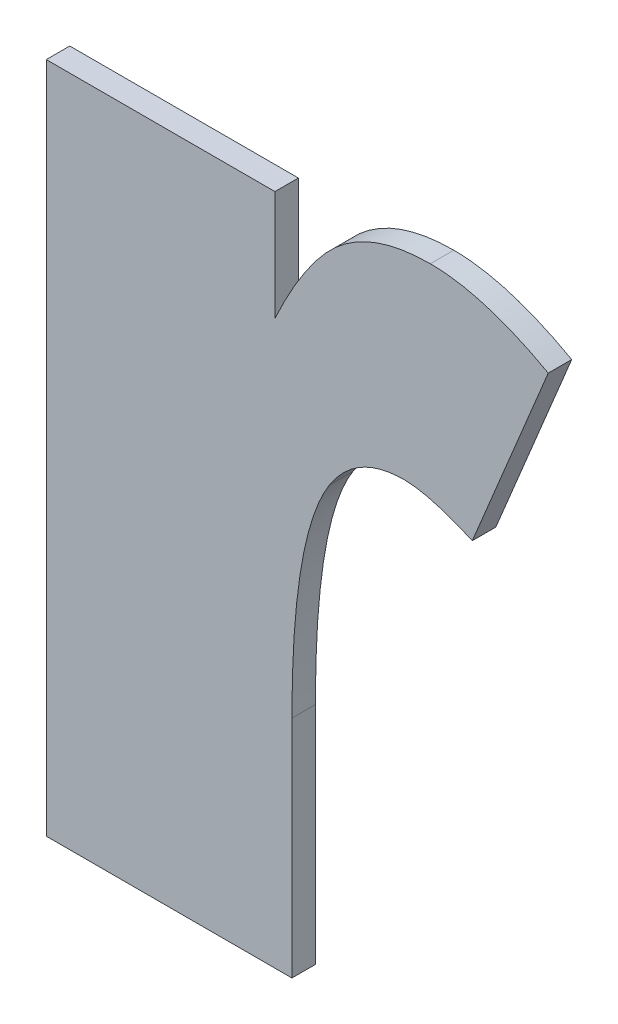
ISO-10303-21;
HEADER;
FILE_DESCRIPTION(('STEP AP214'),'2;1');
FILE_NAME('part.step','',(''),(''),'','','');
FILE_SCHEMA(('AUTOMOTIVE_DESIGN { 1 0 10303 214 1 1 1 1 }'));
ENDSEC;
DATA;
#1=APPLICATION_CONTEXT('core data for automotive mechanical design processes');
#2=APPLICATION_PROTOCOL_DEFINITION('international standard','automotive_design',2000,#1);
#3=PRODUCT_CONTEXT('',#1,'mechanical');
#4=PRODUCT('Part','Part','',(#3));
#5=PRODUCT_RELATED_PRODUCT_CATEGORY('part','',(#4));
#6=PRODUCT_DEFINITION_FORMATION('','',#4);
#7=PRODUCT_DEFINITION_CONTEXT('part definition',#1,'design');
#8=PRODUCT_DEFINITION('design','',#6,#7);
#9=PRODUCT_DEFINITION_SHAPE('','',#8);
#10=(LENGTH_UNIT() NAMED_UNIT(*) SI_UNIT(.MILLI.,.METRE.));
#11=(NAMED_UNIT(*) PLANE_ANGLE_UNIT() SI_UNIT($,.RADIAN.));
#12=(NAMED_UNIT(*) SI_UNIT($,.STERADIAN.) SOLID_ANGLE_UNIT());
#13=UNCERTAINTY_MEASURE_WITH_UNIT(LENGTH_MEASURE(1.E-05),#10,'distance_accuracy_value','');
#14=(GEOMETRIC_REPRESENTATION_CONTEXT(3) GLOBAL_UNCERTAINTY_ASSIGNED_CONTEXT((#13)) GLOBAL_UNIT_ASSIGNED_CONTEXT((#10,
#11,#12)) REPRESENTATION_CONTEXT('',''));
#15=CARTESIAN_POINT('',(0.,0.,0.));
#16=DIRECTION('',(0.,0.,1.));
#17=DIRECTION('',(1.,0.,0.));
#18=AXIS2_PLACEMENT_3D('',#15,#16,#17);
#19=CARTESIAN_POINT('',(0.959673311300421,-0.722568280483534,0.));
#20=DIRECTION('',(1.,0.,0.));
#21=DIRECTION('',(0.,1.,0.));
#22=AXIS2_PLACEMENT_3D('',#19,#20,#21);
#23=PLANE('',#22);
#24=DIRECTION('',(0.,1.,0.));
#25=VECTOR('',#24,1.);
#26=CARTESIAN_POINT('',(0.959673311300421,-0.722568280483534,0.));
#27=LINE('',#26,#25);
#28=CARTESIAN_POINT('',(0.959673311300421,-0.722568280483534,0.));
#29=VERTEX_POINT('',#28);
#30=CARTESIAN_POINT('',(0.959673311300421,-0.693812631181233,0.));
#31=VERTEX_POINT('',#30);
#32=EDGE_CURVE('E11',#29,#31,#27,.T.);
#33=ORIENTED_EDGE('',*,*,#32,.T.);
#34=DIRECTION('',(0.,0.,1.));
#35=VECTOR('',#34,1.);
#36=CARTESIAN_POINT('',(0.959673311300421,-0.693812631181233,0.));
#37=LINE('',#36,#35);
#38=CARTESIAN_POINT('',(0.959673311300421,-0.693812631181233,0.003));
#39=VERTEX_POINT('',#38);
#40=EDGE_CURVE('E24',#31,#39,#37,.T.);
#41=ORIENTED_EDGE('',*,*,#40,.T.);
#42=DIRECTION('',(0.,1.,0.));
#43=VECTOR('',#42,1.);
#44=CARTESIAN_POINT('',(0.959673311300421,-0.722568280483534,0.003));
#45=LINE('',#44,#43);
#46=CARTESIAN_POINT('',(0.959673311300421,-0.722568280483534,0.003));
#47=VERTEX_POINT('',#46);
#48=EDGE_CURVE('E118',#47,#39,#45,.T.);
#49=ORIENTED_EDGE('',*,*,#48,.F.);
#50=DIRECTION('',(0.,0.,1.));
#51=VECTOR('',#50,1.);
#52=CARTESIAN_POINT('',(0.959673311300421,-0.722568280483534,0.));
#53=LINE('',#52,#51);
#54=EDGE_CURVE('E241',#29,#47,#53,.T.);
#55=ORIENTED_EDGE('',*,*,#54,.F.);
#56=EDGE_LOOP('',(#33,#41,#49,#55));
#57=FACE_BOUND('',#56,.T.);
#58=ADVANCED_FACE('F17',(#57),#23,.T.);
#59=CARTESIAN_POINT('',(0.928293138450689,-0.722568280483534,0.));
#60=DIRECTION('',(0.,-1.,0.));
#61=DIRECTION('',(1.,0.,0.));
#62=AXIS2_PLACEMENT_3D('',#59,#60,#61);
#63=PLANE('',#62);
#64=DIRECTION('',(1.,0.,0.));
#65=VECTOR('',#64,1.);
#66=CARTESIAN_POINT('',(0.928293138450689,-0.722568280483534,0.));
#67=LINE('',#66,#65);
#68=CARTESIAN_POINT('',(0.928293138450689,-0.722568280483534,0.));
#69=VERTEX_POINT('',#68);
#70=EDGE_CURVE('E238',#69,#29,#67,.T.);
#71=ORIENTED_EDGE('',*,*,#70,.T.);
#72=ORIENTED_EDGE('',*,*,#54,.T.);
#73=DIRECTION('',(1.,0.,0.));
#74=VECTOR('',#73,1.);
#75=CARTESIAN_POINT('',(0.928293138450689,-0.722568280483534,0.003));
#76=LINE('',#75,#74);
#77=CARTESIAN_POINT('',(0.928293138450689,-0.722568280483534,0.003));
#78=VERTEX_POINT('',#77);
#79=EDGE_CURVE('E236',#78,#47,#76,.T.);
#80=ORIENTED_EDGE('',*,*,#79,.F.);
#81=DIRECTION('',(0.,0.,1.));
#82=VECTOR('',#81,1.);
#83=CARTESIAN_POINT('',(0.928293138450689,-0.722568280483534,0.));
#84=LINE('',#83,#82);
#85=EDGE_CURVE('E233',#69,#78,#84,.T.);
#86=ORIENTED_EDGE('',*,*,#85,.F.);
#87=EDGE_LOOP('',(#71,#72,#80,#86));
#88=FACE_BOUND('',#87,.T.);
#89=ADVANCED_FACE('F267',(#88),#63,.T.);
#90=CARTESIAN_POINT('',(0.928293138450689,-0.636643661734989,0.));
#91=DIRECTION('',(-1.,0.,0.));
#92=DIRECTION('',(0.,-1.,0.));
#93=AXIS2_PLACEMENT_3D('',#90,#91,#92);
#94=PLANE('',#93);
#95=DIRECTION('',(0.,-1.,0.));
#96=VECTOR('',#95,1.);
#97=CARTESIAN_POINT('',(0.928293138450689,-0.636643661734989,0.));
#98=LINE('',#97,#96);
#99=CARTESIAN_POINT('',(0.928293138450689,-0.636643661734989,0.));
#100=VERTEX_POINT('',#99);
#101=EDGE_CURVE('E230',#100,#69,#98,.T.);
#102=ORIENTED_EDGE('',*,*,#101,.T.);
#103=ORIENTED_EDGE('',*,*,#85,.T.);
#104=DIRECTION('',(0.,-1.,0.));
#105=VECTOR('',#104,1.);
#106=CARTESIAN_POINT('',(0.928293138450689,-0.636643661734989,0.003));
#107=LINE('',#106,#105);
#108=CARTESIAN_POINT('',(0.928293138450689,-0.636643661734989,0.003));
#109=VERTEX_POINT('',#108);
#110=EDGE_CURVE('E227',#109,#78,#107,.T.);
#111=ORIENTED_EDGE('',*,*,#110,.F.);
#112=DIRECTION('',(0.,0.,1.));
#113=VECTOR('',#112,1.);
#114=CARTESIAN_POINT('',(0.928293138450689,-0.636643661734989,0.));
#115=LINE('',#114,#113);
#116=EDGE_CURVE('E224',#100,#109,#115,.T.);
#117=ORIENTED_EDGE('',*,*,#116,.F.);
#118=EDGE_LOOP('',(#102,#103,#111,#117));
#119=FACE_BOUND('',#118,.T.);
#120=ADVANCED_FACE('F264',(#119),#94,.T.);
#121=CARTESIAN_POINT('',(0.957505226630804,-0.636643661734989,0.));
#122=DIRECTION('',(0.,1.,0.));
#123=DIRECTION('',(-1.,0.,0.));
#124=AXIS2_PLACEMENT_3D('',#121,#122,#123);
#125=PLANE('',#124);
#126=DIRECTION('',(-1.,0.,0.));
#127=VECTOR('',#126,1.);
#128=CARTESIAN_POINT('',(0.957505226630804,-0.636643661734989,0.));
#129=LINE('',#128,#127);
#130=CARTESIAN_POINT('',(0.957505226630804,-0.636643661734989,0.));
#131=VERTEX_POINT('',#130);
#132=EDGE_CURVE('E221',#131,#100,#129,.T.);
#133=ORIENTED_EDGE('',*,*,#132,.T.);
#134=ORIENTED_EDGE('',*,*,#116,.T.);
#135=DIRECTION('',(-1.,0.,0.));
#136=VECTOR('',#135,1.);
#137=CARTESIAN_POINT('',(0.957505226630804,-0.636643661734989,0.003));
#138=LINE('',#137,#136);
#139=CARTESIAN_POINT('',(0.957505226630804,-0.636643661734989,0.003));
#140=VERTEX_POINT('',#139);
#141=EDGE_CURVE('E218',#140,#109,#138,.T.);
#142=ORIENTED_EDGE('',*,*,#141,.F.);
#143=DIRECTION('',(0.,0.,1.));
#144=VECTOR('',#143,1.);
#145=CARTESIAN_POINT('',(0.957505226630804,-0.636643661734989,0.));
#146=LINE('',#145,#144);
#147=EDGE_CURVE('E215',#131,#140,#146,.T.);
#148=ORIENTED_EDGE('',*,*,#147,.F.);
#149=EDGE_LOOP('',(#133,#134,#142,#148));
#150=FACE_BOUND('',#149,.T.);
#151=ADVANCED_FACE('F261',(#150),#125,.T.);
#152=CARTESIAN_POINT('',(0.957505226630804,-0.650679157227781,0.));
#153=DIRECTION('',(1.,0.,0.));
#154=DIRECTION('',(0.,1.,0.));
#155=AXIS2_PLACEMENT_3D('',#152,#153,#154);
#156=PLANE('',#155);
#157=DIRECTION('',(0.,1.,0.));
#158=VECTOR('',#157,1.);
#159=CARTESIAN_POINT('',(0.957505226630804,-0.650679157227781,0.));
#160=LINE('',#159,#158);
#161=CARTESIAN_POINT('',(0.957505226630804,-0.650679157227781,0.));
#162=VERTEX_POINT('',#161);
#163=EDGE_CURVE('E212',#162,#131,#160,.T.);
#164=ORIENTED_EDGE('',*,*,#163,.T.);
#165=ORIENTED_EDGE('',*,*,#147,.T.);
#166=DIRECTION('',(0.,1.,0.));
#167=VECTOR('',#166,1.);
#168=CARTESIAN_POINT('',(0.957505226630804,-0.650679157227781,0.003));
#169=LINE('',#168,#167);
#170=CARTESIAN_POINT('',(0.957505226630804,-0.650679157227781,0.003));
#171=VERTEX_POINT('',#170);
#172=EDGE_CURVE('E209',#171,#140,#169,.T.);
#173=ORIENTED_EDGE('',*,*,#172,.F.);
#174=DIRECTION('',(0.,0.,1.));
#175=VECTOR('',#174,1.);
#176=CARTESIAN_POINT('',(0.957505226630804,-0.650679157227781,0.));
#177=LINE('',#176,#175);
#178=EDGE_CURVE('E203',#162,#171,#177,.T.);
#179=ORIENTED_EDGE('',*,*,#178,.F.);
#180=EDGE_LOOP('',(#164,#165,#173,#179));
#181=FACE_BOUND('',#180,.T.);
#182=ADVANCED_FACE('F258',(#181),#156,.T.);
#183=CARTESIAN_POINT('',(0.977360317815728,-0.634703796504277,0.));
#184=CARTESIAN_POINT('',(0.977360317815728,-0.634703796504277,0.003));
#185=CARTESIAN_POINT('',(0.970741954087347,-0.634703796643713,0.));
#186=CARTESIAN_POINT('',(0.970741954087347,-0.634703796643713,0.003));
#187=CARTESIAN_POINT('',(0.961727286394888,-0.641550380000914,0.));
#188=CARTESIAN_POINT('',(0.961727286394888,-0.641550380000914,0.003));
#189=CARTESIAN_POINT('',(0.957505226630804,-0.650679157227781,0.));
#190=CARTESIAN_POINT('',(0.957505226630804,-0.650679157227781,0.003));
#191=B_SPLINE_SURFACE_WITH_KNOTS('',2,1,((#183,#184),(#185,#186),(#187,#188),(#189,#190)),
.UNSPECIFIED.,.F.,.F.,.F.,(3,1,3),(2,2),(-2.,-1.,0.),(0.,0.0003),.UNSPECIFIED.);
#192=CARTESIAN_POINT('',(0.977360317815728,-0.634703796504277,0.));
#193=CARTESIAN_POINT('',(0.970741954087347,-0.634703796643713,0.));
#194=CARTESIAN_POINT('',(0.961727286394888,-0.641550380000914,0.));
#195=CARTESIAN_POINT('',(0.957505226630804,-0.650679157227781,0.));
#196=B_SPLINE_CURVE_WITH_KNOTS('',2,(#192,#193,#194,#195),.UNSPECIFIED.,.F.,.F.,(3,1,3),(-2.,
-1.,0.),.UNSPECIFIED.);
#197=CARTESIAN_POINT('',(0.977360317815728,-0.634703796504277,0.));
#198=VERTEX_POINT('',#197);
#199=EDGE_CURVE('E195',#198,#162,#196,.T.);
#200=CARTESIAN_POINT('',(0.977360317815728,-0.634703796504277,0.003));
#201=CARTESIAN_POINT('',(0.970741954087347,-0.634703796643713,0.003));
#202=CARTESIAN_POINT('',(0.961727286394888,-0.641550380000914,0.003));
#203=CARTESIAN_POINT('',(0.957505226630804,-0.650679157227781,0.003));
#204=B_SPLINE_CURVE_WITH_KNOTS('',2,(#200,#201,#202,#203),.UNSPECIFIED.,.F.,.F.,(3,1,3),(-2.,
-1.,0.),.UNSPECIFIED.);
#205=CARTESIAN_POINT('',(0.977360317815728,-0.634703796504277,0.003));
#206=VERTEX_POINT('',#205);
#207=EDGE_CURVE('E190',#206,#171,#204,.T.);
#208=DIRECTION('',(0.,0.,1.));
#209=VECTOR('',#208,1.);
#210=CARTESIAN_POINT('',(0.977360317815728,-0.634703796504277,0.));
#211=LINE('',#210,#209);
#212=EDGE_CURVE('E184',#198,#206,#211,.T.);
#213=ORIENTED_EDGE('',*,*,#199,.T.);
#214=ORIENTED_EDGE('',*,*,#178,.T.);
#215=ORIENTED_EDGE('',*,*,#207,.F.);
#216=ORIENTED_EDGE('',*,*,#212,.F.);
#217=EDGE_LOOP('',(#213,#214,#215,#216));
#218=FACE_BOUND('',#217,.T.);
#219=ADVANCED_FACE('F255',(#218),#191,.T.);
#220=CARTESIAN_POINT('',(0.992422800783596,-0.639268185282421,0.));
#221=CARTESIAN_POINT('',(0.992422800783596,-0.639268185282421,0.003));
#222=CARTESIAN_POINT('',(0.984206893287916,-0.634703810355245,0.));
#223=CARTESIAN_POINT('',(0.984206893287916,-0.634703810355245,0.003));
#224=CARTESIAN_POINT('',(0.977360317815728,-0.634703796504277,0.));
#225=CARTESIAN_POINT('',(0.977360317815728,-0.634703796504277,0.003));
#226=B_SPLINE_SURFACE_WITH_KNOTS('',2,1,((#220,#221),(#222,#223),(#224,#225)),.UNSPECIFIED.,.F.,
.F.,.F.,(3,3),(2,2),(-1.,0.),(0.,0.0003),.UNSPECIFIED.);
#227=CARTESIAN_POINT('',(0.992422800783596,-0.639268185282421,0.));
#228=CARTESIAN_POINT('',(0.984206893287916,-0.634703810355245,0.));
#229=CARTESIAN_POINT('',(0.977360317815728,-0.634703796504277,0.));
#230=B_SPLINE_CURVE_WITH_KNOTS('',2,(#227,#228,#229),.UNSPECIFIED.,.F.,.F.,(3,3),(-1.,0.),.UNSPECIFIED.);
#231=CARTESIAN_POINT('',(0.992422800783596,-0.639268185282421,0.));
#232=VERTEX_POINT('',#231);
#233=EDGE_CURVE('E176',#232,#198,#230,.T.);
#234=CARTESIAN_POINT('',(0.992422800783596,-0.639268185282421,0.003));
#235=CARTESIAN_POINT('',(0.984206893287916,-0.634703810355245,0.003));
#236=CARTESIAN_POINT('',(0.977360317815728,-0.634703796504277,0.003));
#237=B_SPLINE_CURVE_WITH_KNOTS('',2,(#234,#235,#236),.UNSPECIFIED.,.F.,.F.,(3,3),(-1.,0.),.UNSPECIFIED.);
#238=CARTESIAN_POINT('',(0.992422800783596,-0.639268185282421,0.003));
#239=VERTEX_POINT('',#238);
#240=EDGE_CURVE('E171',#239,#206,#237,.T.);
#241=DIRECTION('',(0.,0.,1.));
#242=VECTOR('',#241,1.);
#243=CARTESIAN_POINT('',(0.992422800783596,-0.639268185282421,0.));
#244=LINE('',#243,#242);
#245=EDGE_CURVE('E168',#232,#239,#244,.T.);
#246=ORIENTED_EDGE('',*,*,#233,.T.);
#247=ORIENTED_EDGE('',*,*,#212,.T.);
#248=ORIENTED_EDGE('',*,*,#240,.F.);
#249=ORIENTED_EDGE('',*,*,#245,.F.);
#250=EDGE_LOOP('',(#246,#247,#248,#249));
#251=FACE_BOUND('',#250,.T.);
#252=ADVANCED_FACE('F252',(#251),#226,.T.);
#253=CARTESIAN_POINT('',(0.982723474630046,-0.662660677770404,0.));
#254=DIRECTION('',(0.923742113571684,-0.38301502270031,0.));
#255=DIRECTION('',(0.38301502270031,0.923742113571684,0.));
#256=AXIS2_PLACEMENT_3D('',#253,#254,#255);
#257=PLANE('',#256);
#258=DIRECTION('',(0.38301502270031,0.923742113571684,0.));
#259=VECTOR('',#258,1.);
#260=CARTESIAN_POINT('',(0.982723474630046,-0.662660677770404,0.));
#261=LINE('',#260,#259);
#262=CARTESIAN_POINT('',(0.982723474630046,-0.662660677770404,0.));
#263=VERTEX_POINT('',#262);
#264=EDGE_CURVE('E165',#263,#232,#261,.T.);
#265=ORIENTED_EDGE('',*,*,#264,.T.);
#266=ORIENTED_EDGE('',*,*,#245,.T.);
#267=DIRECTION('',(0.38301502270031,0.923742113571684,0.));
#268=VECTOR('',#267,1.);
#269=CARTESIAN_POINT('',(0.982723474630046,-0.662660677770404,0.003));
#270=LINE('',#269,#268);
#271=CARTESIAN_POINT('',(0.982723474630046,-0.662660677770404,0.003));
#272=VERTEX_POINT('',#271);
#273=EDGE_CURVE('E162',#272,#239,#270,.T.);
#274=ORIENTED_EDGE('',*,*,#273,.F.);
#275=DIRECTION('',(0.,0.,1.));
#276=VECTOR('',#275,1.);
#277=CARTESIAN_POINT('',(0.982723474630046,-0.662660677770404,0.));
#278=LINE('',#277,#276);
#279=EDGE_CURVE('E156',#263,#272,#278,.T.);
#280=ORIENTED_EDGE('',*,*,#279,.F.);
#281=EDGE_LOOP('',(#265,#266,#274,#280));
#282=FACE_BOUND('',#281,.T.);
#283=ADVANCED_FACE('F249',(#282),#257,.T.);
#284=CARTESIAN_POINT('',(0.974051135951572,-0.660264373661884,0.));
#285=CARTESIAN_POINT('',(0.974051135951572,-0.660264373661884,0.003));
#286=CARTESIAN_POINT('',(0.977246208096205,-0.660264371843956,0.));
#287=CARTESIAN_POINT('',(0.977246208096205,-0.660264371843956,0.003));
#288=CARTESIAN_POINT('',(0.982723474630046,-0.662660677770404,0.));
#289=CARTESIAN_POINT('',(0.982723474630046,-0.662660677770404,0.003));
#290=B_SPLINE_SURFACE_WITH_KNOTS('',2,1,((#284,#285),(#286,#287),(#288,#289)),.UNSPECIFIED.,.F.,
.F.,.F.,(3,3),(2,2),(-1.,0.),(0.,0.0003),.UNSPECIFIED.);
#291=CARTESIAN_POINT('',(0.974051135951572,-0.660264373661884,0.));
#292=CARTESIAN_POINT('',(0.977246208096205,-0.660264371843956,0.));
#293=CARTESIAN_POINT('',(0.982723474630046,-0.662660677770404,0.));
#294=B_SPLINE_CURVE_WITH_KNOTS('',2,(#291,#292,#293),.UNSPECIFIED.,.F.,.F.,(3,3),(-1.,0.),.UNSPECIFIED.);
#295=CARTESIAN_POINT('',(0.974051135951572,-0.660264373661884,0.));
#296=VERTEX_POINT('',#295);
#297=EDGE_CURVE('E148',#296,#263,#294,.T.);
#298=CARTESIAN_POINT('',(0.974051135951572,-0.660264373661884,0.003));
#299=CARTESIAN_POINT('',(0.977246208096205,-0.660264371843956,0.003));
#300=CARTESIAN_POINT('',(0.982723474630046,-0.662660677770404,0.003));
#301=B_SPLINE_CURVE_WITH_KNOTS('',2,(#298,#299,#300),.UNSPECIFIED.,.F.,.F.,(3,3),(-1.,0.),.UNSPECIFIED.);
#302=CARTESIAN_POINT('',(0.974051135951572,-0.660264373661884,0.003));
#303=VERTEX_POINT('',#302);
#304=EDGE_CURVE('E144',#303,#272,#301,.T.);
#305=DIRECTION('',(0.,0.,1.));
#306=VECTOR('',#305,1.);
#307=CARTESIAN_POINT('',(0.974051135951572,-0.660264373661884,0.));
#308=LINE('',#307,#306);
#309=EDGE_CURVE('E103',#296,#303,#308,.T.);
#310=ORIENTED_EDGE('',*,*,#297,.T.);
#311=ORIENTED_EDGE('',*,*,#279,.T.);
#312=ORIENTED_EDGE('',*,*,#304,.F.);
#313=ORIENTED_EDGE('',*,*,#309,.F.);
#314=EDGE_LOOP('',(#310,#311,#312,#313));
#315=FACE_BOUND('',#314,.T.);
#316=ADVANCED_FACE('F247',(#315),#290,.T.);
#317=CARTESIAN_POINT('',(0.964465919517469,-0.665627530476201,0.));
#318=CARTESIAN_POINT('',(0.964465919517469,-0.665627530476201,0.003));
#319=CARTESIAN_POINT('',(0.96788921102113,-0.660264373610875,0.));
#320=CARTESIAN_POINT('',(0.96788921102113,-0.660264373610875,0.003));
#321=CARTESIAN_POINT('',(0.974051135951572,-0.660264373661884,0.));
#322=CARTESIAN_POINT('',(0.974051135951572,-0.660264373661884,0.003));
#323=B_SPLINE_SURFACE_WITH_KNOTS('',2,1,((#317,#318),(#319,#320),(#321,#322)),.UNSPECIFIED.,.F.,
.F.,.F.,(3,3),(2,2),(-1.,0.),(0.,0.0003),.UNSPECIFIED.);
#324=CARTESIAN_POINT('',(0.964465919517469,-0.665627530476201,0.));
#325=CARTESIAN_POINT('',(0.96788921102113,-0.660264373610875,0.));
#326=CARTESIAN_POINT('',(0.974051135951572,-0.660264373661884,0.));
#327=B_SPLINE_CURVE_WITH_KNOTS('',2,(#324,#325,#326),.UNSPECIFIED.,.F.,.F.,(3,3),(-1.,0.),.UNSPECIFIED.);
#328=CARTESIAN_POINT('',(0.964465919517469,-0.665627530476201,0.));
#329=VERTEX_POINT('',#328);
#330=EDGE_CURVE('E107',#329,#296,#327,.T.);
#331=CARTESIAN_POINT('',(0.964465919517469,-0.665627530476201,0.003));
#332=CARTESIAN_POINT('',(0.96788921102113,-0.660264373610875,0.003));
#333=CARTESIAN_POINT('',(0.974051135951572,-0.660264373661884,0.003));
#334=B_SPLINE_CURVE_WITH_KNOTS('',2,(#331,#332,#333),.UNSPECIFIED.,.F.,.F.,(3,3),(-1.,0.),.UNSPECIFIED.);
#335=CARTESIAN_POINT('',(0.964465919517469,-0.665627530476201,0.003));
#336=VERTEX_POINT('',#335);
#337=EDGE_CURVE('E96',#336,#303,#334,.T.);
#338=DIRECTION('',(0.,0.,1.));
#339=VECTOR('',#338,1.);
#340=CARTESIAN_POINT('',(0.964465919517469,-0.665627530476201,0.));
#341=LINE('',#340,#339);
#342=EDGE_CURVE('E100',#329,#336,#341,.T.);
#343=ORIENTED_EDGE('',*,*,#330,.T.);
#344=ORIENTED_EDGE('',*,*,#309,.T.);
#345=ORIENTED_EDGE('',*,*,#337,.F.);
#346=ORIENTED_EDGE('',*,*,#342,.F.);
#347=EDGE_LOOP('',(#343,#344,#345,#346));
#348=FACE_BOUND('',#347,.T.);
#349=ADVANCED_FACE('F99',(#348),#323,.T.);
#350=CARTESIAN_POINT('',(0.959673311300421,-0.693812631181233,0.));
#351=CARTESIAN_POINT('',(0.959673311300421,-0.693812631181233,0.003));
#352=CARTESIAN_POINT('',(0.95967330729947,-0.673158771960145,0.));
#353=CARTESIAN_POINT('',(0.95967330729947,-0.673158771960145,0.003));
#354=CARTESIAN_POINT('',(0.964465919517469,-0.665627530476201,0.));
#355=CARTESIAN_POINT('',(0.964465919517469,-0.665627530476201,0.003));
#356=B_SPLINE_SURFACE_WITH_KNOTS('',2,1,((#350,#351),(#352,#353),(#354,#355)),.UNSPECIFIED.,.F.,
.F.,.F.,(3,3),(2,2),(-1.,0.),(0.,0.0003),.UNSPECIFIED.);
#357=CARTESIAN_POINT('',(0.959673311300421,-0.693812631181233,0.));
#358=CARTESIAN_POINT('',(0.95967330729947,-0.673158771960145,0.));
#359=CARTESIAN_POINT('',(0.964465919517469,-0.665627530476201,0.));
#360=B_SPLINE_CURVE_WITH_KNOTS('',2,(#357,#358,#359),.UNSPECIFIED.,.F.,.F.,(3,3),(-1.,0.),.UNSPECIFIED.);
#361=EDGE_CURVE('E113',#31,#329,#360,.T.);
#362=CARTESIAN_POINT('',(0.959673311300421,-0.693812631181233,0.003));
#363=CARTESIAN_POINT('',(0.95967330729947,-0.673158771960145,0.003));
#364=CARTESIAN_POINT('',(0.964465919517469,-0.665627530476201,0.003));
#365=B_SPLINE_CURVE_WITH_KNOTS('',2,(#362,#363,#364),.UNSPECIFIED.,.F.,.F.,(3,3),(-1.,0.),.UNSPECIFIED.);
#366=EDGE_CURVE('E112',#39,#336,#365,.T.);
#367=ORIENTED_EDGE('',*,*,#361,.T.);
#368=ORIENTED_EDGE('',*,*,#342,.T.);
#369=ORIENTED_EDGE('',*,*,#366,.F.);
#370=ORIENTED_EDGE('',*,*,#40,.F.);
#371=EDGE_LOOP('',(#367,#368,#369,#370));
#372=FACE_BOUND('',#371,.T.);
#373=ADVANCED_FACE('F111',(#372),#356,.T.);
#374=CARTESIAN_POINT('',(0.960357969617142,-0.678636038493905,0.003));
#375=DIRECTION('',(0.,0.,1.));
#376=DIRECTION('',(1.,0.,0.));
#377=AXIS2_PLACEMENT_3D('',#374,#375,#376);
#378=PLANE('',#377);
#379=ORIENTED_EDGE('',*,*,#366,.T.);
#380=ORIENTED_EDGE('',*,*,#337,.T.);
#381=ORIENTED_EDGE('',*,*,#304,.T.);
#382=ORIENTED_EDGE('',*,*,#273,.T.);
#383=ORIENTED_EDGE('',*,*,#240,.T.);
#384=ORIENTED_EDGE('',*,*,#207,.T.);
#385=ORIENTED_EDGE('',*,*,#172,.T.);
#386=ORIENTED_EDGE('',*,*,#141,.T.);
#387=ORIENTED_EDGE('',*,*,#110,.T.);
#388=ORIENTED_EDGE('',*,*,#79,.T.);
#389=ORIENTED_EDGE('',*,*,#48,.T.);
#390=EDGE_LOOP('',(#379,#380,#381,#382,#383,#384,#385,#386,#387,#388,#389));
#391=FACE_BOUND('',#390,.T.);
#392=ADVANCED_FACE('F116',(#391),#378,.T.);
#393=CARTESIAN_POINT('',(0.960357969617142,-0.678636038493905,0.));
#394=DIRECTION('',(0.,0.,1.));
#395=DIRECTION('',(1.,0.,0.));
#396=AXIS2_PLACEMENT_3D('',#393,#394,#395);
#397=PLANE('',#396);
#398=ORIENTED_EDGE('',*,*,#361,.F.);
#399=ORIENTED_EDGE('',*,*,#32,.F.);
#400=ORIENTED_EDGE('',*,*,#70,.F.);
#401=ORIENTED_EDGE('',*,*,#101,.F.);
#402=ORIENTED_EDGE('',*,*,#132,.F.);
#403=ORIENTED_EDGE('',*,*,#163,.F.);
#404=ORIENTED_EDGE('',*,*,#199,.F.);
#405=ORIENTED_EDGE('',*,*,#233,.F.);
#406=ORIENTED_EDGE('',*,*,#264,.F.);
#407=ORIENTED_EDGE('',*,*,#297,.F.);
#408=ORIENTED_EDGE('',*,*,#330,.F.);
#409=EDGE_LOOP('',(#398,#399,#400,#401,#402,#403,#404,#405,#406,#407,#408));
#410=FACE_BOUND('',#409,.T.);
#411=ADVANCED_FACE('F244',(#410),#397,.F.);
#412=CLOSED_SHELL('',(#58,#89,#120,#151,#182,#219,#252,#283,#316,#349,#373,#392,#411));
#413=MANIFOLD_SOLID_BREP('B1',#412);
#414=ADVANCED_BREP_SHAPE_REPRESENTATION('',(#18,#413),#14);
#415=SHAPE_DEFINITION_REPRESENTATION(#9,#414);
ENDSEC;
END-ISO-10303-21;
